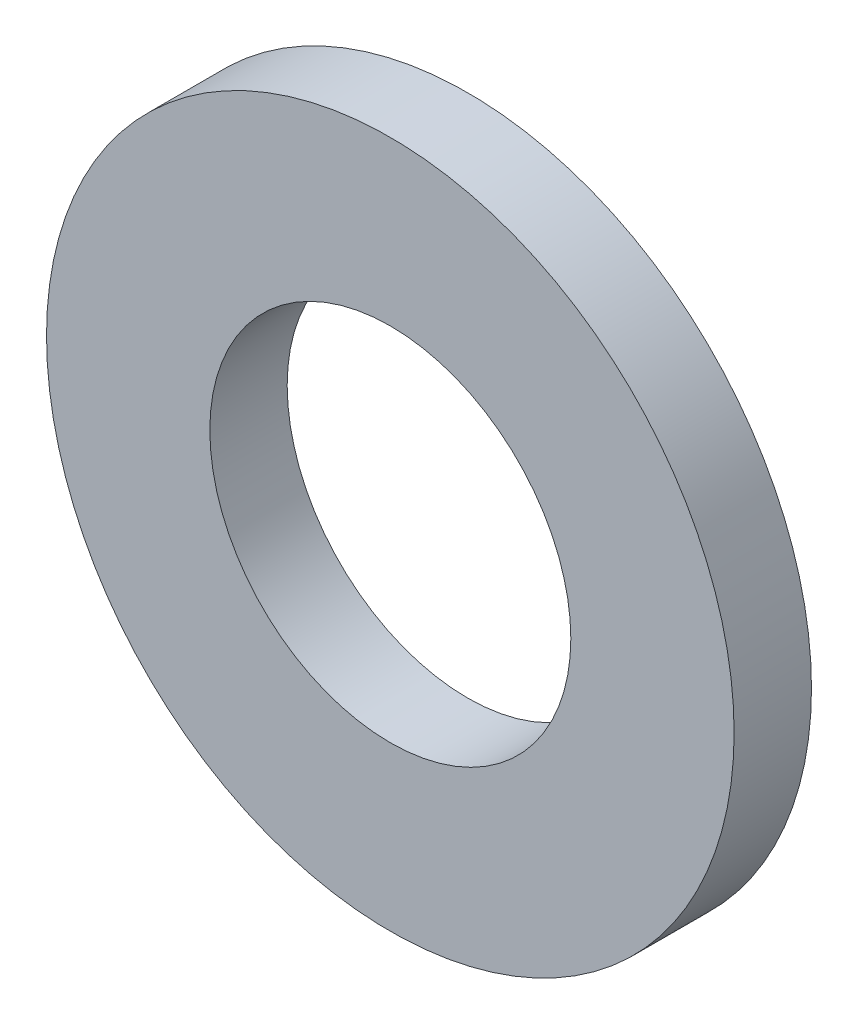
ISO-10303-21;
HEADER;
FILE_DESCRIPTION(('STEP AP214'),'2;1');
FILE_NAME('part.step','',(''),(''),'','','');
FILE_SCHEMA(('AUTOMOTIVE_DESIGN { 1 0 10303 214 1 1 1 1 }'));
ENDSEC;
DATA;
#1=APPLICATION_CONTEXT('core data for automotive mechanical design processes');
#2=APPLICATION_PROTOCOL_DEFINITION('international standard','automotive_design',2000,#1);
#3=PRODUCT_CONTEXT('',#1,'mechanical');
#4=PRODUCT('Part','Part','',(#3));
#5=PRODUCT_RELATED_PRODUCT_CATEGORY('part','',(#4));
#6=PRODUCT_DEFINITION_FORMATION('','',#4);
#7=PRODUCT_DEFINITION_CONTEXT('part definition',#1,'design');
#8=PRODUCT_DEFINITION('design','',#6,#7);
#9=PRODUCT_DEFINITION_SHAPE('','',#8);
#10=(LENGTH_UNIT() NAMED_UNIT(*) SI_UNIT(.MILLI.,.METRE.));
#11=(NAMED_UNIT(*) PLANE_ANGLE_UNIT() SI_UNIT($,.RADIAN.));
#12=(NAMED_UNIT(*) SI_UNIT($,.STERADIAN.) SOLID_ANGLE_UNIT());
#13=UNCERTAINTY_MEASURE_WITH_UNIT(LENGTH_MEASURE(1.E-05),#10,'distance_accuracy_value','');
#14=(GEOMETRIC_REPRESENTATION_CONTEXT(3) GLOBAL_UNCERTAINTY_ASSIGNED_CONTEXT((#13)) GLOBAL_UNIT_ASSIGNED_CONTEXT((#10,
#11,#12)) REPRESENTATION_CONTEXT('',''));
#15=CARTESIAN_POINT('',(0.,0.,0.));
#16=DIRECTION('',(0.,0.,1.));
#17=DIRECTION('',(1.,0.,0.));
#18=AXIS2_PLACEMENT_3D('',#15,#16,#17);
#19=CARTESIAN_POINT('',(0.,0.,1.8));
#20=DIRECTION('',(0.,0.,1.));
#21=DIRECTION('',(1.,0.,0.));
#22=AXIS2_PLACEMENT_3D('',#19,#20,#21);
#23=PLANE('',#22);
#24=CARTESIAN_POINT('',(0.,0.,1.8));
#25=DIRECTION('',(0.,0.,1.));
#26=DIRECTION('',(1.,0.,0.));
#27=AXIS2_PLACEMENT_3D('',#24,#25,#26);
#28=CIRCLE('',#27,8.);
#29=CARTESIAN_POINT('',(8.,0.,1.8));
#30=VERTEX_POINT('',#29);
#31=EDGE_CURVE('E10',#30,#30,#28,.T.);
#32=ORIENTED_EDGE('',*,*,#31,.T.);
#33=EDGE_LOOP('',(#32));
#34=FACE_BOUND('',#33,.T.);
#35=CARTESIAN_POINT('',(0.,0.,1.8));
#36=DIRECTION('',(0.,0.,1.));
#37=DIRECTION('',(1.,0.,0.));
#38=AXIS2_PLACEMENT_3D('',#35,#36,#37);
#39=CIRCLE('',#38,4.2);
#40=CARTESIAN_POINT('',(4.2,0.,1.8));
#41=VERTEX_POINT('',#40);
#42=EDGE_CURVE('E40',#41,#41,#39,.T.);
#43=ORIENTED_EDGE('',*,*,#42,.F.);
#44=EDGE_LOOP('',(#43));
#45=FACE_BOUND('',#44,.T.);
#46=ADVANCED_FACE('F29',(#34,#45),#23,.T.);
#47=CARTESIAN_POINT('',(0.,0.,0.));
#48=DIRECTION('',(0.,0.,1.));
#49=DIRECTION('',(1.,0.,0.));
#50=AXIS2_PLACEMENT_3D('',#47,#48,#49);
#51=PLANE('',#50);
#52=CARTESIAN_POINT('',(0.,0.,0.));
#53=DIRECTION('',(0.,0.,1.));
#54=DIRECTION('',(1.,0.,0.));
#55=AXIS2_PLACEMENT_3D('',#52,#53,#54);
#56=CIRCLE('',#55,8.);
#57=CARTESIAN_POINT('',(8.,0.,0.));
#58=VERTEX_POINT('',#57);
#59=EDGE_CURVE('E33',#58,#58,#56,.T.);
#60=ORIENTED_EDGE('',*,*,#59,.F.);
#61=EDGE_LOOP('',(#60));
#62=FACE_BOUND('',#61,.T.);
#63=CARTESIAN_POINT('',(0.,0.,0.));
#64=DIRECTION('',(0.,0.,1.));
#65=DIRECTION('',(1.,0.,0.));
#66=AXIS2_PLACEMENT_3D('',#63,#64,#65);
#67=CIRCLE('',#66,4.2);
#68=CARTESIAN_POINT('',(4.2,0.,0.));
#69=VERTEX_POINT('',#68);
#70=EDGE_CURVE('E42',#69,#69,#67,.T.);
#71=ORIENTED_EDGE('',*,*,#70,.T.);
#72=EDGE_LOOP('',(#71));
#73=FACE_BOUND('',#72,.T.);
#74=ADVANCED_FACE('F52',(#62,#73),#51,.F.);
#75=CARTESIAN_POINT('',(0.,0.,1.8));
#76=DIRECTION('',(0.,0.,-1.));
#77=DIRECTION('',(-1.,0.,0.));
#78=AXIS2_PLACEMENT_3D('',#75,#76,#77);
#79=CYLINDRICAL_SURFACE('',#78,8.);
#80=ORIENTED_EDGE('',*,*,#31,.F.);
#81=EDGE_LOOP('',(#80));
#82=FACE_BOUND('',#81,.T.);
#83=ORIENTED_EDGE('',*,*,#59,.T.);
#84=EDGE_LOOP('',(#83));
#85=FACE_BOUND('',#84,.T.);
#86=ADVANCED_FACE('F31',(#82,#85),#79,.T.);
#87=CARTESIAN_POINT('',(0.,0.,1.8));
#88=DIRECTION('',(0.,0.,-1.));
#89=DIRECTION('',(-1.,0.,0.));
#90=AXIS2_PLACEMENT_3D('',#87,#88,#89);
#91=CYLINDRICAL_SURFACE('',#90,4.2);
#92=ORIENTED_EDGE('',*,*,#42,.T.);
#93=EDGE_LOOP('',(#92));
#94=FACE_BOUND('',#93,.T.);
#95=ORIENTED_EDGE('',*,*,#70,.F.);
#96=EDGE_LOOP('',(#95));
#97=FACE_BOUND('',#96,.T.);
#98=ADVANCED_FACE('F48',(#94,#97),#91,.F.);
#99=CLOSED_SHELL('',(#46,#74,#86,#98));
#100=MANIFOLD_SOLID_BREP('B2',#99);
#101=ADVANCED_BREP_SHAPE_REPRESENTATION('',(#18,#100),#14);
#102=SHAPE_DEFINITION_REPRESENTATION(#9,#101);
ENDSEC;
END-ISO-10303-21;
